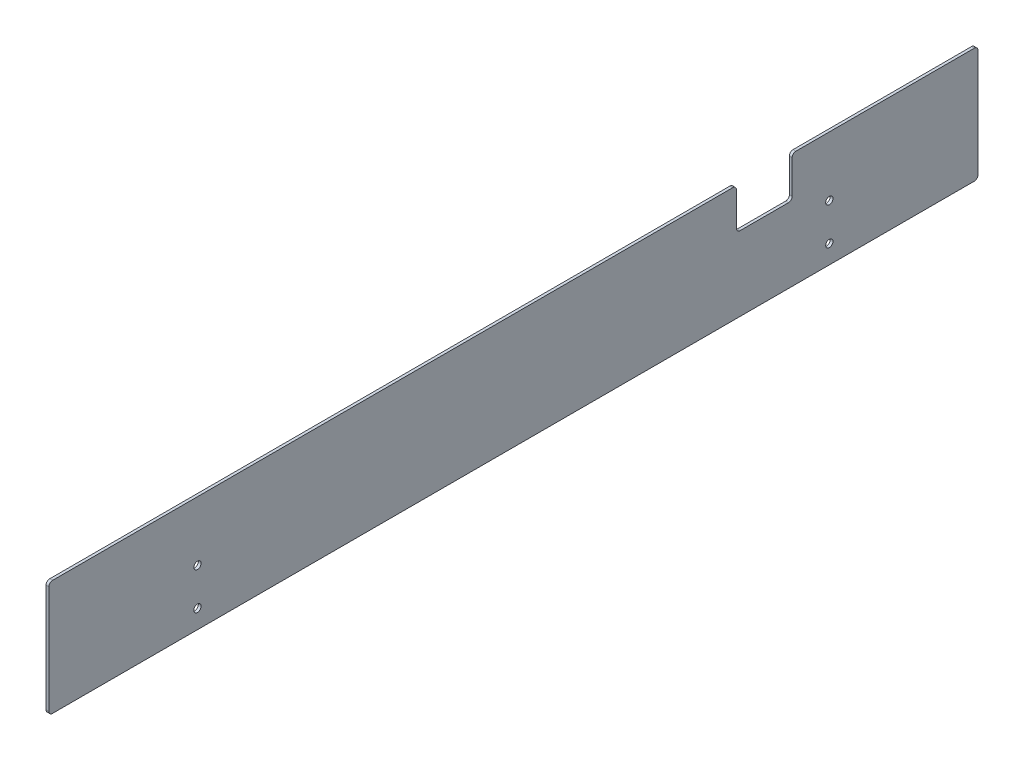
ISO-10303-21;
HEADER;
FILE_DESCRIPTION(('STEP AP214'),'2;1');
FILE_NAME('part.step','',(''),(''),'','','');
FILE_SCHEMA(('AUTOMOTIVE_DESIGN { 1 0 10303 214 1 1 1 1 }'));
ENDSEC;
DATA;
#1=APPLICATION_CONTEXT('core data for automotive mechanical design processes');
#2=APPLICATION_PROTOCOL_DEFINITION('international standard','automotive_design',2000,#1);
#3=PRODUCT_CONTEXT('',#1,'mechanical');
#4=PRODUCT('Part','Part','',(#3));
#5=PRODUCT_RELATED_PRODUCT_CATEGORY('part','',(#4));
#6=PRODUCT_DEFINITION_FORMATION('','',#4);
#7=PRODUCT_DEFINITION_CONTEXT('part definition',#1,'design');
#8=PRODUCT_DEFINITION('design','',#6,#7);
#9=PRODUCT_DEFINITION_SHAPE('','',#8);
#10=(LENGTH_UNIT() NAMED_UNIT(*) SI_UNIT(.MILLI.,.METRE.));
#11=(NAMED_UNIT(*) PLANE_ANGLE_UNIT() SI_UNIT($,.RADIAN.));
#12=(NAMED_UNIT(*) SI_UNIT($,.STERADIAN.) SOLID_ANGLE_UNIT());
#13=UNCERTAINTY_MEASURE_WITH_UNIT(LENGTH_MEASURE(1.E-05),#10,'distance_accuracy_value','');
#14=(GEOMETRIC_REPRESENTATION_CONTEXT(3) GLOBAL_UNCERTAINTY_ASSIGNED_CONTEXT((#13)) GLOBAL_UNIT_ASSIGNED_CONTEXT((#10,
#11,#12)) REPRESENTATION_CONTEXT('',''));
#15=CARTESIAN_POINT('',(0.,0.,0.));
#16=DIRECTION('',(0.,0.,1.));
#17=DIRECTION('',(1.,0.,0.));
#18=AXIS2_PLACEMENT_3D('',#15,#16,#17);
#19=CARTESIAN_POINT('',(1.5,-78.2925531914894,269.946808510638));
#20=DIRECTION('',(0.,0.,-1.));
#21=DIRECTION('',(-1.,0.,0.));
#22=AXIS2_PLACEMENT_3D('',#19,#20,#21);
#23=PLANE('',#22);
#24=DIRECTION('',(0.,-1.,0.));
#25=VECTOR('',#24,1.);
#26=CARTESIAN_POINT('',(0.,-78.2925531914894,269.946808510638));
#27=LINE('',#26,#25);
#28=CARTESIAN_POINT('',(0.,-80.2925531914894,269.946808510638));
#29=VERTEX_POINT('',#28);
#30=CARTESIAN_POINT('',(0.,-138.292553191489,269.946808510638));
#31=VERTEX_POINT('',#30);
#32=EDGE_CURVE('E265',#29,#31,#27,.T.);
#33=ORIENTED_EDGE('',*,*,#32,.T.);
#34=DIRECTION('',(-1.,0.,0.));
#35=VECTOR('',#34,1.);
#36=CARTESIAN_POINT('',(1.5,-138.292553191489,269.946808510638));
#37=LINE('',#36,#35);
#38=CARTESIAN_POINT('',(1.5,-138.292553191489,269.946808510638));
#39=VERTEX_POINT('',#38);
#40=EDGE_CURVE('E233',#31,#39,#37,.F.);
#41=ORIENTED_EDGE('',*,*,#40,.T.);
#42=DIRECTION('',(0.,-1.,0.));
#43=VECTOR('',#42,1.);
#44=CARTESIAN_POINT('',(1.5,-78.2925531914894,269.946808510638));
#45=LINE('',#44,#43);
#46=CARTESIAN_POINT('',(1.5,-80.2925531914894,269.946808510638));
#47=VERTEX_POINT('',#46);
#48=EDGE_CURVE('E172',#47,#39,#45,.T.);
#49=ORIENTED_EDGE('',*,*,#48,.F.);
#50=DIRECTION('',(-1.,0.,0.));
#51=VECTOR('',#50,1.);
#52=CARTESIAN_POINT('',(1.5,-80.2925531914894,269.946808510638));
#53=LINE('',#52,#51);
#54=EDGE_CURVE('E230',#47,#29,#53,.T.);
#55=ORIENTED_EDGE('',*,*,#54,.T.);
#56=EDGE_LOOP('',(#33,#41,#49,#55));
#57=FACE_BOUND('',#56,.T.);
#58=ADVANCED_FACE('F33',(#57),#23,.F.);
#59=CARTESIAN_POINT('',(1.5,-140.292553191489,269.946808510638));
#60=DIRECTION('',(0.,1.,0.));
#61=DIRECTION('',(0.,0.,1.));
#62=AXIS2_PLACEMENT_3D('',#59,#60,#61);
#63=PLANE('',#62);
#64=DIRECTION('',(0.,0.,-1.));
#65=VECTOR('',#64,1.);
#66=CARTESIAN_POINT('',(0.,-140.292553191489,269.946808510638));
#67=LINE('',#66,#65);
#68=CARTESIAN_POINT('',(0.,-140.292553191489,267.946808510638));
#69=VERTEX_POINT('',#68);
#70=CARTESIAN_POINT('',(0.,-140.292553191489,-228.053191489362));
#71=VERTEX_POINT('',#70);
#72=EDGE_CURVE('E268',#69,#71,#67,.T.);
#73=ORIENTED_EDGE('',*,*,#72,.T.);
#74=DIRECTION('',(-1.,0.,0.));
#75=VECTOR('',#74,1.);
#76=CARTESIAN_POINT('',(1.5,-140.292553191489,-228.053191489362));
#77=LINE('',#76,#75);
#78=CARTESIAN_POINT('',(1.5,-140.292553191489,-228.053191489362));
#79=VERTEX_POINT('',#78);
#80=EDGE_CURVE('E228',#71,#79,#77,.F.);
#81=ORIENTED_EDGE('',*,*,#80,.T.);
#82=DIRECTION('',(0.,0.,-1.));
#83=VECTOR('',#82,1.);
#84=CARTESIAN_POINT('',(1.5,-140.292553191489,269.946808510638));
#85=LINE('',#84,#83);
#86=CARTESIAN_POINT('',(1.5,-140.292553191489,267.946808510638));
#87=VERTEX_POINT('',#86);
#88=EDGE_CURVE('E176',#87,#79,#85,.T.);
#89=ORIENTED_EDGE('',*,*,#88,.F.);
#90=DIRECTION('',(-1.,0.,0.));
#91=VECTOR('',#90,1.);
#92=CARTESIAN_POINT('',(1.5,-140.292553191489,267.946808510638));
#93=LINE('',#92,#91);
#94=EDGE_CURVE('E225',#87,#69,#93,.T.);
#95=ORIENTED_EDGE('',*,*,#94,.T.);
#96=EDGE_LOOP('',(#73,#81,#89,#95));
#97=FACE_BOUND('',#96,.T.);
#98=ADVANCED_FACE('F342',(#97),#63,.F.);
#99=CARTESIAN_POINT('',(1.5,-78.2925531914894,-230.053191489362));
#100=DIRECTION('',(0.,0.,1.));
#101=DIRECTION('',(0.,-1.,0.));
#102=AXIS2_PLACEMENT_3D('',#99,#100,#101);
#103=PLANE('',#102);
#104=DIRECTION('',(0.,1.,0.));
#105=VECTOR('',#104,1.);
#106=CARTESIAN_POINT('',(0.,-78.2925531914894,-230.053191489362));
#107=LINE('',#106,#105);
#108=CARTESIAN_POINT('',(0.,-138.292553191489,-230.053191489362));
#109=VERTEX_POINT('',#108);
#110=CARTESIAN_POINT('',(0.,-80.2925531914894,-230.053191489362));
#111=VERTEX_POINT('',#110);
#112=EDGE_CURVE('E272',#109,#111,#107,.T.);
#113=ORIENTED_EDGE('',*,*,#112,.T.);
#114=DIRECTION('',(-1.,0.,0.));
#115=VECTOR('',#114,1.);
#116=CARTESIAN_POINT('',(1.5,-80.2925531914894,-230.053191489362));
#117=LINE('',#116,#115);
#118=CARTESIAN_POINT('',(1.5,-80.2925531914894,-230.053191489362));
#119=VERTEX_POINT('',#118);
#120=EDGE_CURVE('E223',#111,#119,#117,.F.);
#121=ORIENTED_EDGE('',*,*,#120,.T.);
#122=DIRECTION('',(0.,1.,0.));
#123=VECTOR('',#122,1.);
#124=CARTESIAN_POINT('',(1.5,-78.2925531914894,-230.053191489362));
#125=LINE('',#124,#123);
#126=CARTESIAN_POINT('',(1.5,-138.292553191489,-230.053191489362));
#127=VERTEX_POINT('',#126);
#128=EDGE_CURVE('E289',#127,#119,#125,.T.);
#129=ORIENTED_EDGE('',*,*,#128,.F.);
#130=DIRECTION('',(-1.,0.,0.));
#131=VECTOR('',#130,1.);
#132=CARTESIAN_POINT('',(1.5,-138.292553191489,-230.053191489362));
#133=LINE('',#132,#131);
#134=EDGE_CURVE('E220',#127,#109,#133,.T.);
#135=ORIENTED_EDGE('',*,*,#134,.T.);
#136=EDGE_LOOP('',(#113,#121,#129,#135));
#137=FACE_BOUND('',#136,.T.);
#138=ADVANCED_FACE('F348',(#137),#103,.F.);
#139=CARTESIAN_POINT('',(1.5,-78.2925531914894,-130.053191489362));
#140=DIRECTION('',(0.,-1.,0.));
#141=DIRECTION('',(0.,0.,-1.));
#142=AXIS2_PLACEMENT_3D('',#139,#140,#141);
#143=PLANE('',#142);
#144=DIRECTION('',(0.,0.,1.));
#145=VECTOR('',#144,1.);
#146=CARTESIAN_POINT('',(0.,-78.2925531914894,-130.053191489362));
#147=LINE('',#146,#145);
#148=CARTESIAN_POINT('',(0.,-78.2925531914894,-228.053191489362));
#149=VERTEX_POINT('',#148);
#150=CARTESIAN_POINT('',(0.,-78.2925531914894,-132.053191489362));
#151=VERTEX_POINT('',#150);
#152=EDGE_CURVE('E249',#149,#151,#147,.T.);
#153=ORIENTED_EDGE('',*,*,#152,.T.);
#154=DIRECTION('',(-1.,0.,0.));
#155=VECTOR('',#154,1.);
#156=CARTESIAN_POINT('',(1.5,-78.2925531914894,-132.053191489362));
#157=LINE('',#156,#155);
#158=CARTESIAN_POINT('',(1.5,-78.2925531914894,-132.053191489362));
#159=VERTEX_POINT('',#158);
#160=EDGE_CURVE('E218',#151,#159,#157,.F.);
#161=ORIENTED_EDGE('',*,*,#160,.T.);
#162=DIRECTION('',(0.,0.,1.));
#163=VECTOR('',#162,1.);
#164=CARTESIAN_POINT('',(1.5,-78.2925531914894,-130.053191489362));
#165=LINE('',#164,#163);
#166=CARTESIAN_POINT('',(1.5,-78.2925531914894,-228.053191489362));
#167=VERTEX_POINT('',#166);
#168=EDGE_CURVE('E260',#167,#159,#165,.T.);
#169=ORIENTED_EDGE('',*,*,#168,.F.);
#170=DIRECTION('',(-1.,0.,0.));
#171=VECTOR('',#170,1.);
#172=CARTESIAN_POINT('',(1.5,-78.2925531914894,-228.053191489362));
#173=LINE('',#172,#171);
#174=EDGE_CURVE('E215',#167,#149,#173,.T.);
#175=ORIENTED_EDGE('',*,*,#174,.T.);
#176=EDGE_LOOP('',(#153,#161,#169,#175));
#177=FACE_BOUND('',#176,.T.);
#178=ADVANCED_FACE('F279',(#177),#143,.F.);
#179=CARTESIAN_POINT('',(1.5,-78.2925531914894,-130.053191489362));
#180=DIRECTION('',(0.,0.,-1.));
#181=DIRECTION('',(0.,1.,0.));
#182=AXIS2_PLACEMENT_3D('',#179,#180,#181);
#183=PLANE('',#182);
#184=DIRECTION('',(0.,-1.,0.));
#185=VECTOR('',#184,1.);
#186=CARTESIAN_POINT('',(0.,-78.2925531914894,-130.053191489362));
#187=LINE('',#186,#185);
#188=CARTESIAN_POINT('',(0.,-80.2925531914894,-130.053191489362));
#189=VERTEX_POINT('',#188);
#190=CARTESIAN_POINT('',(0.,-98.2925531914894,-130.053191489362));
#191=VERTEX_POINT('',#190);
#192=EDGE_CURVE('E241',#189,#191,#187,.T.);
#193=ORIENTED_EDGE('',*,*,#192,.T.);
#194=DIRECTION('',(-1.,0.,0.));
#195=VECTOR('',#194,1.);
#196=CARTESIAN_POINT('',(1.5,-98.2925531914894,-130.053191489362));
#197=LINE('',#196,#195);
#198=CARTESIAN_POINT('',(1.5,-98.2925531914894,-130.053191489362));
#199=VERTEX_POINT('',#198);
#200=EDGE_CURVE('E213',#191,#199,#197,.F.);
#201=ORIENTED_EDGE('',*,*,#200,.T.);
#202=DIRECTION('',(0.,-1.,0.));
#203=VECTOR('',#202,1.);
#204=CARTESIAN_POINT('',(1.5,-78.2925531914894,-130.053191489362));
#205=LINE('',#204,#203);
#206=CARTESIAN_POINT('',(1.5,-80.2925531914894,-130.053191489362));
#207=VERTEX_POINT('',#206);
#208=EDGE_CURVE('E256',#207,#199,#205,.T.);
#209=ORIENTED_EDGE('',*,*,#208,.F.);
#210=DIRECTION('',(-1.,0.,0.));
#211=VECTOR('',#210,1.);
#212=CARTESIAN_POINT('',(1.5,-80.2925531914894,-130.053191489362));
#213=LINE('',#212,#211);
#214=EDGE_CURVE('E210',#207,#189,#213,.T.);
#215=ORIENTED_EDGE('',*,*,#214,.T.);
#216=EDGE_LOOP('',(#193,#201,#209,#215));
#217=FACE_BOUND('',#216,.T.);
#218=ADVANCED_FACE('F246',(#217),#183,.F.);
#219=CARTESIAN_POINT('',(1.5,-100.292553191489,-130.053191489362));
#220=DIRECTION('',(0.,-1.,0.));
#221=DIRECTION('',(0.,0.,-1.));
#222=AXIS2_PLACEMENT_3D('',#219,#220,#221);
#223=PLANE('',#222);
#224=DIRECTION('',(0.,0.,1.));
#225=VECTOR('',#224,1.);
#226=CARTESIAN_POINT('',(0.,-100.292553191489,-130.053191489362));
#227=LINE('',#226,#225);
#228=CARTESIAN_POINT('',(0.,-100.292553191489,-128.053191489362));
#229=VERTEX_POINT('',#228);
#230=CARTESIAN_POINT('',(0.,-100.292553191489,-102.053191489362));
#231=VERTEX_POINT('',#230);
#232=EDGE_CURVE('E178',#229,#231,#227,.T.);
#233=ORIENTED_EDGE('',*,*,#232,.T.);
#234=DIRECTION('',(-1.,0.,0.));
#235=VECTOR('',#234,1.);
#236=CARTESIAN_POINT('',(1.5,-100.292553191489,-102.053191489362));
#237=LINE('',#236,#235);
#238=CARTESIAN_POINT('',(1.5,-100.292553191489,-102.053191489362));
#239=VERTEX_POINT('',#238);
#240=EDGE_CURVE('E48',#231,#239,#237,.F.);
#241=ORIENTED_EDGE('',*,*,#240,.T.);
#242=DIRECTION('',(0.,0.,1.));
#243=VECTOR('',#242,1.);
#244=CARTESIAN_POINT('',(1.5,-100.292553191489,-130.053191489362));
#245=LINE('',#244,#243);
#246=CARTESIAN_POINT('',(1.5,-100.292553191489,-128.053191489362));
#247=VERTEX_POINT('',#246);
#248=EDGE_CURVE('E253',#247,#239,#245,.T.);
#249=ORIENTED_EDGE('',*,*,#248,.F.);
#250=DIRECTION('',(-1.,0.,0.));
#251=VECTOR('',#250,1.);
#252=CARTESIAN_POINT('',(0.,-100.292553191489,-128.053191489362));
#253=LINE('',#252,#251);
#254=EDGE_CURVE('E206',#247,#229,#253,.T.);
#255=ORIENTED_EDGE('',*,*,#254,.T.);
#256=EDGE_LOOP('',(#233,#241,#249,#255));
#257=FACE_BOUND('',#256,.T.);
#258=ADVANCED_FACE('F252',(#257),#223,.F.);
#259=CARTESIAN_POINT('',(1.5,-78.2925531914894,-100.053191489362));
#260=DIRECTION('',(0.,0.,1.));
#261=DIRECTION('',(0.,-1.,0.));
#262=AXIS2_PLACEMENT_3D('',#259,#260,#261);
#263=PLANE('',#262);
#264=DIRECTION('',(0.,1.,0.));
#265=VECTOR('',#264,1.);
#266=CARTESIAN_POINT('',(0.,-78.2925531914894,-100.053191489362));
#267=LINE('',#266,#265);
#268=CARTESIAN_POINT('',(0.,-98.2925531914894,-100.053191489362));
#269=VERTEX_POINT('',#268);
#270=CARTESIAN_POINT('',(0.,-80.2925531914894,-100.053191489362));
#271=VERTEX_POINT('',#270);
#272=EDGE_CURVE('E173',#269,#271,#267,.T.);
#273=ORIENTED_EDGE('',*,*,#272,.T.);
#274=DIRECTION('',(-1.,0.,0.));
#275=VECTOR('',#274,1.);
#276=CARTESIAN_POINT('',(1.5,-80.2925531914894,-100.053191489362));
#277=LINE('',#276,#275);
#278=CARTESIAN_POINT('',(1.5,-80.2925531914894,-100.053191489362));
#279=VERTEX_POINT('',#278);
#280=EDGE_CURVE('E151',#271,#279,#277,.F.);
#281=ORIENTED_EDGE('',*,*,#280,.T.);
#282=DIRECTION('',(0.,1.,0.));
#283=VECTOR('',#282,1.);
#284=CARTESIAN_POINT('',(1.5,-78.2925531914894,-100.053191489362));
#285=LINE('',#284,#283);
#286=CARTESIAN_POINT('',(1.5,-98.2925531914894,-100.053191489362));
#287=VERTEX_POINT('',#286);
#288=EDGE_CURVE('E255',#287,#279,#285,.T.);
#289=ORIENTED_EDGE('',*,*,#288,.F.);
#290=DIRECTION('',(-1.,0.,0.));
#291=VECTOR('',#290,1.);
#292=CARTESIAN_POINT('',(0.,-98.2925531914894,-100.053191489362));
#293=LINE('',#292,#291);
#294=EDGE_CURVE('E156',#287,#269,#293,.T.);
#295=ORIENTED_EDGE('',*,*,#294,.T.);
#296=EDGE_LOOP('',(#273,#281,#289,#295));
#297=FACE_BOUND('',#296,.T.);
#298=ADVANCED_FACE('F392',(#297),#263,.F.);
#299=CARTESIAN_POINT('',(1.5,-78.2925531914894,269.946808510638));
#300=DIRECTION('',(0.,-1.,0.));
#301=DIRECTION('',(0.,0.,-1.));
#302=AXIS2_PLACEMENT_3D('',#299,#300,#301);
#303=PLANE('',#302);
#304=DIRECTION('',(0.,0.,1.));
#305=VECTOR('',#304,1.);
#306=CARTESIAN_POINT('',(1.5,-78.2925531914894,269.946808510638));
#307=LINE('',#306,#305);
#308=CARTESIAN_POINT('',(1.5,-78.2925531914894,-98.0531914893615));
#309=VERTEX_POINT('',#308);
#310=CARTESIAN_POINT('',(1.5,-78.2925531914894,267.946808510638));
#311=VERTEX_POINT('',#310);
#312=EDGE_CURVE('E166',#309,#311,#307,.T.);
#313=ORIENTED_EDGE('',*,*,#312,.F.);
#314=DIRECTION('',(-1.,0.,0.));
#315=VECTOR('',#314,1.);
#316=CARTESIAN_POINT('',(1.5,-78.2925531914894,-98.0531914893615));
#317=LINE('',#316,#315);
#318=CARTESIAN_POINT('',(0.,-78.2925531914894,-98.0531914893615));
#319=VERTEX_POINT('',#318);
#320=EDGE_CURVE('E150',#309,#319,#317,.T.);
#321=ORIENTED_EDGE('',*,*,#320,.T.);
#322=DIRECTION('',(0.,0.,1.));
#323=VECTOR('',#322,1.);
#324=CARTESIAN_POINT('',(0.,-78.2925531914894,269.946808510638));
#325=LINE('',#324,#323);
#326=CARTESIAN_POINT('',(0.,-78.2925531914894,267.946808510638));
#327=VERTEX_POINT('',#326);
#328=EDGE_CURVE('E163',#319,#327,#325,.T.);
#329=ORIENTED_EDGE('',*,*,#328,.T.);
#330=DIRECTION('',(-1.,0.,0.));
#331=VECTOR('',#330,1.);
#332=CARTESIAN_POINT('',(1.5,-78.2925531914894,267.946808510638));
#333=LINE('',#332,#331);
#334=EDGE_CURVE('E168',#327,#311,#333,.F.);
#335=ORIENTED_EDGE('',*,*,#334,.T.);
#336=EDGE_LOOP('',(#313,#321,#329,#335));
#337=FACE_BOUND('',#336,.T.);
#338=ADVANCED_FACE('F162',(#337),#303,.F.);
#339=CARTESIAN_POINT('',(1.5,0.,0.));
#340=DIRECTION('',(1.,0.,0.));
#341=DIRECTION('',(0.,0.,-1.));
#342=AXIS2_PLACEMENT_3D('',#339,#340,#341);
#343=PLANE('',#342);
#344=CARTESIAN_POINT('',(1.5,-130.292553191489,-150.053191489362));
#345=DIRECTION('',(1.,0.,0.));
#346=DIRECTION('',(0.,0.,-1.));
#347=AXIS2_PLACEMENT_3D('',#344,#345,#346);
#348=CIRCLE('',#347,1.95);
#349=CARTESIAN_POINT('',(1.5,-130.292553191489,-152.003191489362));
#350=VERTEX_POINT('',#349);
#351=EDGE_CURVE('E269',#350,#350,#348,.T.);
#352=ORIENTED_EDGE('',*,*,#351,.F.);
#353=EDGE_LOOP('',(#352));
#354=FACE_BOUND('',#353,.T.);
#355=CARTESIAN_POINT('',(1.5,-110.292553191489,189.946808510638));
#356=DIRECTION('',(1.,0.,0.));
#357=DIRECTION('',(0.,0.,-1.));
#358=AXIS2_PLACEMENT_3D('',#355,#356,#357);
#359=CIRCLE('',#358,1.95);
#360=CARTESIAN_POINT('',(1.5,-110.292553191489,187.996808510638));
#361=VERTEX_POINT('',#360);
#362=EDGE_CURVE('E296',#361,#361,#359,.T.);
#363=ORIENTED_EDGE('',*,*,#362,.F.);
#364=EDGE_LOOP('',(#363));
#365=FACE_BOUND('',#364,.T.);
#366=CARTESIAN_POINT('',(1.5,-130.292553191489,189.946808510638));
#367=DIRECTION('',(1.,0.,0.));
#368=DIRECTION('',(0.,0.,-1.));
#369=AXIS2_PLACEMENT_3D('',#366,#367,#368);
#370=CIRCLE('',#369,1.95);
#371=CARTESIAN_POINT('',(1.5,-130.292553191489,187.996808510638));
#372=VERTEX_POINT('',#371);
#373=EDGE_CURVE('E299',#372,#372,#370,.T.);
#374=ORIENTED_EDGE('',*,*,#373,.F.);
#375=EDGE_LOOP('',(#374));
#376=FACE_BOUND('',#375,.T.);
#377=CARTESIAN_POINT('',(1.5,-110.292553191489,-150.053191489362));
#378=DIRECTION('',(1.,0.,0.));
#379=DIRECTION('',(0.,0.,-1.));
#380=AXIS2_PLACEMENT_3D('',#377,#378,#379);
#381=CIRCLE('',#380,1.95);
#382=CARTESIAN_POINT('',(1.5,-110.292553191489,-152.003191489362));
#383=VERTEX_POINT('',#382);
#384=EDGE_CURVE('E302',#383,#383,#381,.T.);
#385=ORIENTED_EDGE('',*,*,#384,.F.);
#386=EDGE_LOOP('',(#385));
#387=FACE_BOUND('',#386,.T.);
#388=ORIENTED_EDGE('',*,*,#288,.T.);
#389=CARTESIAN_POINT('',(1.5,-80.2925531914894,-98.0531914893615));
#390=DIRECTION('',(1.,0.,0.));
#391=DIRECTION('',(0.,0.,-1.));
#392=AXIS2_PLACEMENT_3D('',#389,#390,#391);
#393=CIRCLE('',#392,2.);
#394=EDGE_CURVE('E204',#279,#309,#393,.T.);
#395=ORIENTED_EDGE('',*,*,#394,.T.);
#396=ORIENTED_EDGE('',*,*,#312,.T.);
#397=CARTESIAN_POINT('',(1.5,-80.2925531914894,267.946808510638));
#398=DIRECTION('',(1.,0.,0.));
#399=DIRECTION('',(0.,0.,-1.));
#400=AXIS2_PLACEMENT_3D('',#397,#398,#399);
#401=CIRCLE('',#400,2.);
#402=EDGE_CURVE('E194',#311,#47,#401,.T.);
#403=ORIENTED_EDGE('',*,*,#402,.T.);
#404=ORIENTED_EDGE('',*,*,#48,.T.);
#405=CARTESIAN_POINT('',(1.5,-138.292553191489,267.946808510638));
#406=DIRECTION('',(1.,0.,0.));
#407=DIRECTION('',(0.,0.,-1.));
#408=AXIS2_PLACEMENT_3D('',#405,#406,#407);
#409=CIRCLE('',#408,2.);
#410=EDGE_CURVE('E196',#39,#87,#409,.T.);
#411=ORIENTED_EDGE('',*,*,#410,.T.);
#412=ORIENTED_EDGE('',*,*,#88,.T.);
#413=CARTESIAN_POINT('',(1.5,-138.292553191489,-228.053191489362));
#414=DIRECTION('',(1.,0.,0.));
#415=DIRECTION('',(0.,0.,-1.));
#416=AXIS2_PLACEMENT_3D('',#413,#414,#415);
#417=CIRCLE('',#416,2.);
#418=EDGE_CURVE('E198',#79,#127,#417,.T.);
#419=ORIENTED_EDGE('',*,*,#418,.T.);
#420=ORIENTED_EDGE('',*,*,#128,.T.);
#421=CARTESIAN_POINT('',(1.5,-80.2925531914894,-228.053191489362));
#422=DIRECTION('',(1.,0.,0.));
#423=DIRECTION('',(0.,0.,-1.));
#424=AXIS2_PLACEMENT_3D('',#421,#422,#423);
#425=CIRCLE('',#424,2.);
#426=EDGE_CURVE('E200',#119,#167,#425,.T.);
#427=ORIENTED_EDGE('',*,*,#426,.T.);
#428=ORIENTED_EDGE('',*,*,#168,.T.);
#429=CARTESIAN_POINT('',(1.5,-80.2925531914894,-132.053191489362));
#430=DIRECTION('',(1.,0.,0.));
#431=DIRECTION('',(0.,0.,-1.));
#432=AXIS2_PLACEMENT_3D('',#429,#430,#431);
#433=CIRCLE('',#432,2.);
#434=EDGE_CURVE('E202',#159,#207,#433,.T.);
#435=ORIENTED_EDGE('',*,*,#434,.T.);
#436=ORIENTED_EDGE('',*,*,#208,.T.);
#437=CARTESIAN_POINT('',(1.5,-98.2925531914894,-128.053191489362));
#438=DIRECTION('',(1.,0.,0.));
#439=DIRECTION('',(0.,0.,-1.));
#440=AXIS2_PLACEMENT_3D('',#437,#438,#439);
#441=CIRCLE('',#440,2.);
#442=EDGE_CURVE('E11',#199,#247,#441,.F.);
#443=ORIENTED_EDGE('',*,*,#442,.T.);
#444=ORIENTED_EDGE('',*,*,#248,.T.);
#445=CARTESIAN_POINT('',(1.5,-98.2925531914894,-102.053191489362));
#446=DIRECTION('',(1.,0.,0.));
#447=DIRECTION('',(0.,0.,-1.));
#448=AXIS2_PLACEMENT_3D('',#445,#446,#447);
#449=CIRCLE('',#448,2.);
#450=EDGE_CURVE('E237',#239,#287,#449,.F.);
#451=ORIENTED_EDGE('',*,*,#450,.T.);
#452=EDGE_LOOP('',(#388,#395,#396,#403,#404,#411,#412,#419,#420,#427,#428,#435,#436,#443,#444,#451));
#453=FACE_BOUND('',#452,.T.);
#454=ADVANCED_FACE('F286',(#354,#365,#376,#387,#453),#343,.T.);
#455=CARTESIAN_POINT('',(0.,0.,0.));
#456=DIRECTION('',(1.,0.,0.));
#457=DIRECTION('',(0.,0.,-1.));
#458=AXIS2_PLACEMENT_3D('',#455,#456,#457);
#459=PLANE('',#458);
#460=CARTESIAN_POINT('',(0.,-130.292553191489,-150.053191489362));
#461=DIRECTION('',(-1.,0.,0.));
#462=DIRECTION('',(0.,0.,1.));
#463=AXIS2_PLACEMENT_3D('',#460,#461,#462);
#464=CIRCLE('',#463,1.95);
#465=CARTESIAN_POINT('',(0.,-130.292553191489,-148.103191489362));
#466=VERTEX_POINT('',#465);
#467=EDGE_CURVE('E308',#466,#466,#464,.T.);
#468=ORIENTED_EDGE('',*,*,#467,.F.);
#469=EDGE_LOOP('',(#468));
#470=FACE_BOUND('',#469,.T.);
#471=CARTESIAN_POINT('',(0.,-110.292553191489,189.946808510638));
#472=DIRECTION('',(-1.,0.,0.));
#473=DIRECTION('',(0.,0.,1.));
#474=AXIS2_PLACEMENT_3D('',#471,#472,#473);
#475=CIRCLE('',#474,1.95);
#476=CARTESIAN_POINT('',(0.,-110.292553191489,191.896808510638));
#477=VERTEX_POINT('',#476);
#478=EDGE_CURVE('E309',#477,#477,#475,.T.);
#479=ORIENTED_EDGE('',*,*,#478,.F.);
#480=EDGE_LOOP('',(#479));
#481=FACE_BOUND('',#480,.T.);
#482=CARTESIAN_POINT('',(0.,-130.292553191489,189.946808510638));
#483=DIRECTION('',(-1.,0.,0.));
#484=DIRECTION('',(0.,0.,1.));
#485=AXIS2_PLACEMENT_3D('',#482,#483,#484);
#486=CIRCLE('',#485,1.95);
#487=CARTESIAN_POINT('',(0.,-130.292553191489,191.896808510638));
#488=VERTEX_POINT('',#487);
#489=EDGE_CURVE('E312',#488,#488,#486,.T.);
#490=ORIENTED_EDGE('',*,*,#489,.F.);
#491=EDGE_LOOP('',(#490));
#492=FACE_BOUND('',#491,.T.);
#493=CARTESIAN_POINT('',(0.,-110.292553191489,-150.053191489362));
#494=DIRECTION('',(-1.,0.,0.));
#495=DIRECTION('',(0.,0.,1.));
#496=AXIS2_PLACEMENT_3D('',#493,#494,#495);
#497=CIRCLE('',#496,1.95);
#498=CARTESIAN_POINT('',(0.,-110.292553191489,-148.103191489362));
#499=VERTEX_POINT('',#498);
#500=EDGE_CURVE('E305',#499,#499,#497,.T.);
#501=ORIENTED_EDGE('',*,*,#500,.F.);
#502=EDGE_LOOP('',(#501));
#503=FACE_BOUND('',#502,.T.);
#504=ORIENTED_EDGE('',*,*,#328,.F.);
#505=CARTESIAN_POINT('',(0.,-80.2925531914894,-98.0531914893615));
#506=DIRECTION('',(1.,0.,0.));
#507=DIRECTION('',(0.,0.,-1.));
#508=AXIS2_PLACEMENT_3D('',#505,#506,#507);
#509=CIRCLE('',#508,2.);
#510=EDGE_CURVE('E146',#319,#271,#509,.F.);
#511=ORIENTED_EDGE('',*,*,#510,.T.);
#512=ORIENTED_EDGE('',*,*,#272,.F.);
#513=CARTESIAN_POINT('',(0.,-98.2925531914894,-102.053191489362));
#514=DIRECTION('',(1.,0.,0.));
#515=DIRECTION('',(0.,0.,-1.));
#516=AXIS2_PLACEMENT_3D('',#513,#514,#515);
#517=CIRCLE('',#516,2.);
#518=EDGE_CURVE('E235',#269,#231,#517,.T.);
#519=ORIENTED_EDGE('',*,*,#518,.T.);
#520=ORIENTED_EDGE('',*,*,#232,.F.);
#521=CARTESIAN_POINT('',(0.,-98.2925531914894,-128.053191489362));
#522=DIRECTION('',(1.,0.,0.));
#523=DIRECTION('',(0.,0.,-1.));
#524=AXIS2_PLACEMENT_3D('',#521,#522,#523);
#525=CIRCLE('',#524,2.);
#526=EDGE_CURVE('E41',#229,#191,#525,.T.);
#527=ORIENTED_EDGE('',*,*,#526,.T.);
#528=ORIENTED_EDGE('',*,*,#192,.F.);
#529=CARTESIAN_POINT('',(0.,-80.2925531914894,-132.053191489362));
#530=DIRECTION('',(1.,0.,0.));
#531=DIRECTION('',(0.,0.,-1.));
#532=AXIS2_PLACEMENT_3D('',#529,#530,#531);
#533=CIRCLE('',#532,2.);
#534=EDGE_CURVE('E157',#189,#151,#533,.F.);
#535=ORIENTED_EDGE('',*,*,#534,.T.);
#536=ORIENTED_EDGE('',*,*,#152,.F.);
#537=CARTESIAN_POINT('',(0.,-80.2925531914894,-228.053191489362));
#538=DIRECTION('',(1.,0.,0.));
#539=DIRECTION('',(0.,0.,-1.));
#540=AXIS2_PLACEMENT_3D('',#537,#538,#539);
#541=CIRCLE('',#540,2.);
#542=EDGE_CURVE('E188',#149,#111,#541,.F.);
#543=ORIENTED_EDGE('',*,*,#542,.T.);
#544=ORIENTED_EDGE('',*,*,#112,.F.);
#545=CARTESIAN_POINT('',(0.,-138.292553191489,-228.053191489362));
#546=DIRECTION('',(1.,0.,0.));
#547=DIRECTION('',(0.,0.,-1.));
#548=AXIS2_PLACEMENT_3D('',#545,#546,#547);
#549=CIRCLE('',#548,2.);
#550=EDGE_CURVE('E186',#109,#71,#549,.F.);
#551=ORIENTED_EDGE('',*,*,#550,.T.);
#552=ORIENTED_EDGE('',*,*,#72,.F.);
#553=CARTESIAN_POINT('',(0.,-138.292553191489,267.946808510638));
#554=DIRECTION('',(1.,0.,0.));
#555=DIRECTION('',(0.,0.,-1.));
#556=AXIS2_PLACEMENT_3D('',#553,#554,#555);
#557=CIRCLE('',#556,2.);
#558=EDGE_CURVE('E184',#69,#31,#557,.F.);
#559=ORIENTED_EDGE('',*,*,#558,.T.);
#560=ORIENTED_EDGE('',*,*,#32,.F.);
#561=CARTESIAN_POINT('',(0.,-80.2925531914894,267.946808510638));
#562=DIRECTION('',(1.,0.,0.));
#563=DIRECTION('',(0.,0.,-1.));
#564=AXIS2_PLACEMENT_3D('',#561,#562,#563);
#565=CIRCLE('',#564,2.);
#566=EDGE_CURVE('E167',#29,#327,#565,.F.);
#567=ORIENTED_EDGE('',*,*,#566,.T.);
#568=EDGE_LOOP('',(#504,#511,#512,#519,#520,#527,#528,#535,#536,#543,#544,#551,#552,#559,#560,#567));
#569=FACE_BOUND('',#568,.T.);
#570=ADVANCED_FACE('F170',(#470,#481,#492,#503,#569),#459,.F.);
#571=CARTESIAN_POINT('',(1.5,-80.2925531914894,-98.0531914893615));
#572=DIRECTION('',(-1.,0.,0.));
#573=DIRECTION('',(0.,0.,1.));
#574=AXIS2_PLACEMENT_3D('',#571,#572,#573);
#575=CYLINDRICAL_SURFACE('',#574,2.);
#576=ORIENTED_EDGE('',*,*,#394,.F.);
#577=ORIENTED_EDGE('',*,*,#280,.F.);
#578=ORIENTED_EDGE('',*,*,#510,.F.);
#579=ORIENTED_EDGE('',*,*,#320,.F.);
#580=EDGE_LOOP('',(#576,#577,#578,#579));
#581=FACE_BOUND('',#580,.T.);
#582=ADVANCED_FACE('F149',(#581),#575,.T.);
#583=CARTESIAN_POINT('',(1.5,-98.2925531914894,-102.053191489362));
#584=DIRECTION('',(1.,0.,0.));
#585=DIRECTION('',(0.,0.,-1.));
#586=AXIS2_PLACEMENT_3D('',#583,#584,#585);
#587=CYLINDRICAL_SURFACE('',#586,2.);
#588=ORIENTED_EDGE('',*,*,#450,.F.);
#589=ORIENTED_EDGE('',*,*,#240,.F.);
#590=ORIENTED_EDGE('',*,*,#518,.F.);
#591=ORIENTED_EDGE('',*,*,#294,.F.);
#592=EDGE_LOOP('',(#588,#589,#590,#591));
#593=FACE_BOUND('',#592,.T.);
#594=ADVANCED_FACE('F355',(#593),#587,.F.);
#595=CARTESIAN_POINT('',(1.5,-98.2925531914894,-128.053191489362));
#596=DIRECTION('',(1.,0.,0.));
#597=DIRECTION('',(0.,0.,-1.));
#598=AXIS2_PLACEMENT_3D('',#595,#596,#597);
#599=CYLINDRICAL_SURFACE('',#598,2.);
#600=ORIENTED_EDGE('',*,*,#442,.F.);
#601=ORIENTED_EDGE('',*,*,#200,.F.);
#602=ORIENTED_EDGE('',*,*,#526,.F.);
#603=ORIENTED_EDGE('',*,*,#254,.F.);
#604=EDGE_LOOP('',(#600,#601,#602,#603));
#605=FACE_BOUND('',#604,.T.);
#606=ADVANCED_FACE('F251',(#605),#599,.F.);
#607=CARTESIAN_POINT('',(1.5,-80.2925531914894,-132.053191489362));
#608=DIRECTION('',(-1.,0.,0.));
#609=DIRECTION('',(0.,0.,1.));
#610=AXIS2_PLACEMENT_3D('',#607,#608,#609);
#611=CYLINDRICAL_SURFACE('',#610,2.);
#612=ORIENTED_EDGE('',*,*,#434,.F.);
#613=ORIENTED_EDGE('',*,*,#160,.F.);
#614=ORIENTED_EDGE('',*,*,#534,.F.);
#615=ORIENTED_EDGE('',*,*,#214,.F.);
#616=EDGE_LOOP('',(#612,#613,#614,#615));
#617=FACE_BOUND('',#616,.T.);
#618=ADVANCED_FACE('F285',(#617),#611,.T.);
#619=CARTESIAN_POINT('',(1.5,-80.2925531914894,-228.053191489362));
#620=DIRECTION('',(-1.,0.,0.));
#621=DIRECTION('',(0.,0.,1.));
#622=AXIS2_PLACEMENT_3D('',#619,#620,#621);
#623=CYLINDRICAL_SURFACE('',#622,2.);
#624=ORIENTED_EDGE('',*,*,#426,.F.);
#625=ORIENTED_EDGE('',*,*,#120,.F.);
#626=ORIENTED_EDGE('',*,*,#542,.F.);
#627=ORIENTED_EDGE('',*,*,#174,.F.);
#628=EDGE_LOOP('',(#624,#625,#626,#627));
#629=FACE_BOUND('',#628,.T.);
#630=ADVANCED_FACE('F363',(#629),#623,.T.);
#631=CARTESIAN_POINT('',(1.5,-138.292553191489,-228.053191489362));
#632=DIRECTION('',(-1.,0.,0.));
#633=DIRECTION('',(0.,0.,1.));
#634=AXIS2_PLACEMENT_3D('',#631,#632,#633);
#635=CYLINDRICAL_SURFACE('',#634,2.);
#636=ORIENTED_EDGE('',*,*,#418,.F.);
#637=ORIENTED_EDGE('',*,*,#80,.F.);
#638=ORIENTED_EDGE('',*,*,#550,.F.);
#639=ORIENTED_EDGE('',*,*,#134,.F.);
#640=EDGE_LOOP('',(#636,#637,#638,#639));
#641=FACE_BOUND('',#640,.T.);
#642=ADVANCED_FACE('F366',(#641),#635,.T.);
#643=CARTESIAN_POINT('',(1.5,-138.292553191489,267.946808510638));
#644=DIRECTION('',(-1.,0.,0.));
#645=DIRECTION('',(0.,0.,1.));
#646=AXIS2_PLACEMENT_3D('',#643,#644,#645);
#647=CYLINDRICAL_SURFACE('',#646,2.);
#648=ORIENTED_EDGE('',*,*,#410,.F.);
#649=ORIENTED_EDGE('',*,*,#40,.F.);
#650=ORIENTED_EDGE('',*,*,#558,.F.);
#651=ORIENTED_EDGE('',*,*,#94,.F.);
#652=EDGE_LOOP('',(#648,#649,#650,#651));
#653=FACE_BOUND('',#652,.T.);
#654=ADVANCED_FACE('F337',(#653),#647,.T.);
#655=CARTESIAN_POINT('',(1.5,-80.2925531914894,267.946808510638));
#656=DIRECTION('',(-1.,0.,0.));
#657=DIRECTION('',(0.,0.,1.));
#658=AXIS2_PLACEMENT_3D('',#655,#656,#657);
#659=CYLINDRICAL_SURFACE('',#658,2.);
#660=ORIENTED_EDGE('',*,*,#402,.F.);
#661=ORIENTED_EDGE('',*,*,#334,.F.);
#662=ORIENTED_EDGE('',*,*,#566,.F.);
#663=ORIENTED_EDGE('',*,*,#54,.F.);
#664=EDGE_LOOP('',(#660,#661,#662,#663));
#665=FACE_BOUND('',#664,.T.);
#666=ADVANCED_FACE('F35',(#665),#659,.T.);
#667=CARTESIAN_POINT('',(10.,-110.292553191489,-150.053191489362));
#668=DIRECTION('',(-1.,0.,0.));
#669=DIRECTION('',(0.,0.,1.));
#670=AXIS2_PLACEMENT_3D('',#667,#668,#669);
#671=CYLINDRICAL_SURFACE('',#670,1.95);
#672=ORIENTED_EDGE('',*,*,#384,.T.);
#673=EDGE_LOOP('',(#672));
#674=FACE_BOUND('',#673,.T.);
#675=ORIENTED_EDGE('',*,*,#500,.T.);
#676=EDGE_LOOP('',(#675));
#677=FACE_BOUND('',#676,.T.);
#678=ADVANCED_FACE('F326',(#674,#677),#671,.F.);
#679=CARTESIAN_POINT('',(10.,-130.292553191489,189.946808510638));
#680=DIRECTION('',(-1.,0.,0.));
#681=DIRECTION('',(0.,0.,1.));
#682=AXIS2_PLACEMENT_3D('',#679,#680,#681);
#683=CYLINDRICAL_SURFACE('',#682,1.95);
#684=ORIENTED_EDGE('',*,*,#373,.T.);
#685=EDGE_LOOP('',(#684));
#686=FACE_BOUND('',#685,.T.);
#687=ORIENTED_EDGE('',*,*,#489,.T.);
#688=EDGE_LOOP('',(#687));
#689=FACE_BOUND('',#688,.T.);
#690=ADVANCED_FACE('F318',(#686,#689),#683,.F.);
#691=CARTESIAN_POINT('',(10.,-110.292553191489,189.946808510638));
#692=DIRECTION('',(-1.,0.,0.));
#693=DIRECTION('',(0.,0.,1.));
#694=AXIS2_PLACEMENT_3D('',#691,#692,#693);
#695=CYLINDRICAL_SURFACE('',#694,1.95);
#696=ORIENTED_EDGE('',*,*,#362,.T.);
#697=EDGE_LOOP('',(#696));
#698=FACE_BOUND('',#697,.T.);
#699=ORIENTED_EDGE('',*,*,#478,.T.);
#700=EDGE_LOOP('',(#699));
#701=FACE_BOUND('',#700,.T.);
#702=ADVANCED_FACE('F334',(#698,#701),#695,.F.);
#703=CARTESIAN_POINT('',(10.,-130.292553191489,-150.053191489362));
#704=DIRECTION('',(-1.,0.,0.));
#705=DIRECTION('',(0.,0.,1.));
#706=AXIS2_PLACEMENT_3D('',#703,#704,#705);
#707=CYLINDRICAL_SURFACE('',#706,1.95);
#708=ORIENTED_EDGE('',*,*,#351,.T.);
#709=EDGE_LOOP('',(#708));
#710=FACE_BOUND('',#709,.T.);
#711=ORIENTED_EDGE('',*,*,#467,.T.);
#712=EDGE_LOOP('',(#711));
#713=FACE_BOUND('',#712,.T.);
#714=ADVANCED_FACE('F511',(#710,#713),#707,.F.);
#715=CLOSED_SHELL('',(#58,#98,#138,#178,#218,#258,#298,#338,#454,#570,#582,#594,#606,#618,#630,
#642,#654,#666,#678,#690,#702,#714));
#716=MANIFOLD_SOLID_BREP('B2',#715);
#717=ADVANCED_BREP_SHAPE_REPRESENTATION('',(#18,#716),#14);
#718=SHAPE_DEFINITION_REPRESENTATION(#9,#717);
ENDSEC;
END-ISO-10303-21;
